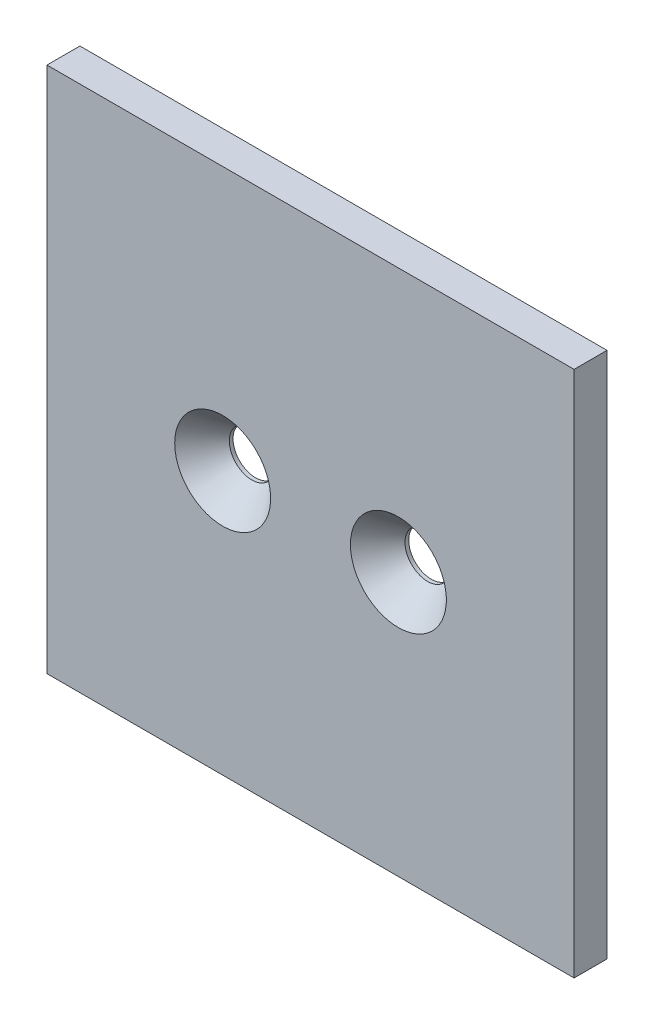
ISO-10303-21;
HEADER;
FILE_DESCRIPTION(('STEP AP214'),'2;1');
FILE_NAME('part.step','',(''),(''),'','','');
FILE_SCHEMA(('AUTOMOTIVE_DESIGN { 1 0 10303 214 1 1 1 1 }'));
ENDSEC;
DATA;
#1=APPLICATION_CONTEXT('core data for automotive mechanical design processes');
#2=APPLICATION_PROTOCOL_DEFINITION('international standard','automotive_design',2000,#1);
#3=PRODUCT_CONTEXT('',#1,'mechanical');
#4=PRODUCT('Part','Part','',(#3));
#5=PRODUCT_RELATED_PRODUCT_CATEGORY('part','',(#4));
#6=PRODUCT_DEFINITION_FORMATION('','',#4);
#7=PRODUCT_DEFINITION_CONTEXT('part definition',#1,'design');
#8=PRODUCT_DEFINITION('design','',#6,#7);
#9=PRODUCT_DEFINITION_SHAPE('','',#8);
#10=(LENGTH_UNIT() NAMED_UNIT(*) SI_UNIT(.MILLI.,.METRE.));
#11=(NAMED_UNIT(*) PLANE_ANGLE_UNIT() SI_UNIT($,.RADIAN.));
#12=(NAMED_UNIT(*) SI_UNIT($,.STERADIAN.) SOLID_ANGLE_UNIT());
#13=UNCERTAINTY_MEASURE_WITH_UNIT(LENGTH_MEASURE(1.E-05),#10,'distance_accuracy_value','');
#14=(GEOMETRIC_REPRESENTATION_CONTEXT(3) GLOBAL_UNCERTAINTY_ASSIGNED_CONTEXT((#13)) GLOBAL_UNIT_ASSIGNED_CONTEXT((#10,
#11,#12)) REPRESENTATION_CONTEXT('',''));
#15=CARTESIAN_POINT('',(0.,0.,0.));
#16=DIRECTION('',(0.,0.,1.));
#17=DIRECTION('',(1.,0.,0.));
#18=AXIS2_PLACEMENT_3D('',#15,#16,#17);
#19=CARTESIAN_POINT('',(0.,0.,2.38125));
#20=DIRECTION('',(0.,0.,1.));
#21=DIRECTION('',(1.,0.,0.));
#22=AXIS2_PLACEMENT_3D('',#19,#20,#21);
#23=PLANE('',#22);
#24=CARTESIAN_POINT('',(-12.7,0.,2.38125));
#25=DIRECTION('',(0.,0.,-1.));
#26=DIRECTION('',(-1.,0.,0.));
#27=AXIS2_PLACEMENT_3D('',#24,#25,#26);
#28=CIRCLE('',#27,6.9342);
#29=CARTESIAN_POINT('',(-19.6342,0.,2.38125));
#30=VERTEX_POINT('',#29);
#31=EDGE_CURVE('E110',#30,#30,#28,.T.);
#32=ORIENTED_EDGE('',*,*,#31,.T.);
#33=EDGE_LOOP('',(#32));
#34=FACE_BOUND('',#33,.T.);
#35=DIRECTION('',(0.,1.,0.));
#36=VECTOR('',#35,1.);
#37=CARTESIAN_POINT('',(38.1,38.1,2.38125));
#38=LINE('',#37,#36);
#39=CARTESIAN_POINT('',(38.1,-38.1,2.38125));
#40=VERTEX_POINT('',#39);
#41=CARTESIAN_POINT('',(38.1,38.1,2.38125));
#42=VERTEX_POINT('',#41);
#43=EDGE_CURVE('E86',#40,#42,#38,.T.);
#44=ORIENTED_EDGE('',*,*,#43,.T.);
#45=DIRECTION('',(-1.,0.,0.));
#46=VECTOR('',#45,1.);
#47=CARTESIAN_POINT('',(-38.1,38.1,2.38125));
#48=LINE('',#47,#46);
#49=CARTESIAN_POINT('',(-38.1,38.1,2.38125));
#50=VERTEX_POINT('',#49);
#51=EDGE_CURVE('E81',#42,#50,#48,.T.);
#52=ORIENTED_EDGE('',*,*,#51,.T.);
#53=DIRECTION('',(0.,-1.,0.));
#54=VECTOR('',#53,1.);
#55=CARTESIAN_POINT('',(-38.1,38.1,2.38125));
#56=LINE('',#55,#54);
#57=CARTESIAN_POINT('',(-38.1,-38.1,2.38125));
#58=VERTEX_POINT('',#57);
#59=EDGE_CURVE('E84',#50,#58,#56,.T.);
#60=ORIENTED_EDGE('',*,*,#59,.T.);
#61=DIRECTION('',(1.,0.,0.));
#62=VECTOR('',#61,1.);
#63=CARTESIAN_POINT('',(-38.1,-38.1,2.38125));
#64=LINE('',#63,#62);
#65=EDGE_CURVE('E51',#58,#40,#64,.T.);
#66=ORIENTED_EDGE('',*,*,#65,.T.);
#67=EDGE_LOOP('',(#44,#52,#60,#66));
#68=FACE_BOUND('',#67,.T.);
#69=CARTESIAN_POINT('',(12.7,0.,2.38125));
#70=DIRECTION('',(0.,0.,-1.));
#71=DIRECTION('',(-1.,0.,0.));
#72=AXIS2_PLACEMENT_3D('',#69,#70,#71);
#73=CIRCLE('',#72,6.9342);
#74=CARTESIAN_POINT('',(5.7658,0.,2.38125));
#75=VERTEX_POINT('',#74);
#76=EDGE_CURVE('E120',#75,#75,#73,.T.);
#77=ORIENTED_EDGE('',*,*,#76,.T.);
#78=EDGE_LOOP('',(#77));
#79=FACE_BOUND('',#78,.T.);
#80=ADVANCED_FACE('F32',(#34,#68,#79),#23,.T.);
#81=CARTESIAN_POINT('',(12.7,0.,2.38125));
#82=DIRECTION('',(0.,0.,-1.));
#83=DIRECTION('',(-1.,0.,0.));
#84=AXIS2_PLACEMENT_3D('',#81,#82,#83);
#85=CYLINDRICAL_SURFACE('',#84,3.2639);
#86=CARTESIAN_POINT('',(12.7,0.,-2.38125));
#87=DIRECTION('',(0.,0.,1.));
#88=DIRECTION('',(1.,0.,0.));
#89=AXIS2_PLACEMENT_3D('',#86,#87,#88);
#90=CIRCLE('',#89,3.2639);
#91=CARTESIAN_POINT('',(9.4361,0.,-2.38125));
#92=VERTEX_POINT('',#91);
#93=EDGE_CURVE('E109',#92,#92,#90,.T.);
#94=CARTESIAN_POINT('',(12.7,0.,-1.84094716502328));
#95=DIRECTION('',(0.,0.,1.));
#96=DIRECTION('',(1.,0.,0.));
#97=AXIS2_PLACEMENT_3D('',#94,#95,#96);
#98=CIRCLE('',#97,3.2639);
#99=CARTESIAN_POINT('',(9.4361,0.,-1.84094716502328));
#100=VERTEX_POINT('',#99);
#101=EDGE_CURVE('E36',#100,#100,#98,.T.);
#102=CARTESIAN_POINT('',(9.4361,0.,-2.38125));
#103=CARTESIAN_POINT('',(9.4361,0.,-2.37562184546899));
#104=CARTESIAN_POINT('',(9.4361,0.,-2.36999369093799));
#105=CARTESIAN_POINT('',(9.4361,0.,-2.35873738187597));
#106=CARTESIAN_POINT('',(9.4361,0.,-2.35310922734496));
#107=CARTESIAN_POINT('',(9.4361,0.,-2.34185291828295));
#108=CARTESIAN_POINT('',(9.4361,0.,-2.33622476375194));
#109=CARTESIAN_POINT('',(9.4361,0.,-2.32496845468993));
#110=CARTESIAN_POINT('',(9.4361,0.,-2.31934030015892));
#111=CARTESIAN_POINT('',(9.4361,0.,-2.3080839910969));
#112=CARTESIAN_POINT('',(9.4361,0.,-2.3024558365659));
#113=CARTESIAN_POINT('',(9.4361,0.,-2.29119952750388));
#114=CARTESIAN_POINT('',(9.4361,0.,-2.28557137297287));
#115=CARTESIAN_POINT('',(9.4361,0.,-2.27431506391086));
#116=CARTESIAN_POINT('',(9.4361,0.,-2.26868690937985));
#117=CARTESIAN_POINT('',(9.4361,0.,-2.25743060031784));
#118=CARTESIAN_POINT('',(9.4361,0.,-2.25180244578683));
#119=CARTESIAN_POINT('',(9.4361,0.,-2.24054613672481));
#120=CARTESIAN_POINT('',(9.4361,0.,-2.23491798219381));
#121=CARTESIAN_POINT('',(9.4361,0.,-2.22366167313179));
#122=CARTESIAN_POINT('',(9.4361,0.,-2.21803351860078));
#123=CARTESIAN_POINT('',(9.4361,0.,-2.20677720953877));
#124=CARTESIAN_POINT('',(9.4361,0.,-2.20114905500776));
#125=CARTESIAN_POINT('',(9.4361,0.,-2.18989274594575));
#126=CARTESIAN_POINT('',(9.4361,0.,-2.18426459141474));
#127=CARTESIAN_POINT('',(9.4361,0.,-2.17300828235272));
#128=CARTESIAN_POINT('',(9.4361,0.,-2.16738012782172));
#129=CARTESIAN_POINT('',(9.4361,0.,-2.1561238187597));
#130=CARTESIAN_POINT('',(9.4361,0.,-2.15049566422869));
#131=CARTESIAN_POINT('',(9.4361,0.,-2.13923935516668));
#132=CARTESIAN_POINT('',(9.4361,0.,-2.13361120063567));
#133=CARTESIAN_POINT('',(9.4361,0.,-2.12235489157366));
#134=CARTESIAN_POINT('',(9.4361,0.,-2.11672673704265));
#135=CARTESIAN_POINT('',(9.4361,0.,-2.10547042798063));
#136=CARTESIAN_POINT('',(9.4361,0.,-2.09984227344963));
#137=CARTESIAN_POINT('',(9.4361,0.,-2.08858596438761));
#138=CARTESIAN_POINT('',(9.4361,0.,-2.0829578098566));
#139=CARTESIAN_POINT('',(9.4361,0.,-2.07170150079459));
#140=CARTESIAN_POINT('',(9.4361,0.,-2.06607334626358));
#141=CARTESIAN_POINT('',(9.4361,0.,-2.05481703720157));
#142=CARTESIAN_POINT('',(9.4361,0.,-2.04918888267056));
#143=CARTESIAN_POINT('',(9.4361,0.,-2.03793257360855));
#144=CARTESIAN_POINT('',(9.4361,0.,-2.03230441907754));
#145=CARTESIAN_POINT('',(9.4361,0.,-2.02104811001552));
#146=CARTESIAN_POINT('',(9.4361,0.,-2.01541995548452));
#147=CARTESIAN_POINT('',(9.4361,0.,-2.0041636464225));
#148=CARTESIAN_POINT('',(9.4361,0.,-1.99853549189149));
#149=CARTESIAN_POINT('',(9.4361,0.,-1.98727918282948));
#150=CARTESIAN_POINT('',(9.4361,0.,-1.98165102829847));
#151=CARTESIAN_POINT('',(9.4361,0.,-1.97039471923646));
#152=CARTESIAN_POINT('',(9.4361,0.,-1.96476656470545));
#153=CARTESIAN_POINT('',(9.4361,0.,-1.95351025564343));
#154=CARTESIAN_POINT('',(9.4361,0.,-1.94788210111243));
#155=CARTESIAN_POINT('',(9.4361,0.,-1.93662579205041));
#156=CARTESIAN_POINT('',(9.4361,0.,-1.9309976375194));
#157=CARTESIAN_POINT('',(9.4361,0.,-1.91974132845739));
#158=CARTESIAN_POINT('',(9.4361,0.,-1.91411317392638));
#159=CARTESIAN_POINT('',(9.4361,0.,-1.90285686486437));
#160=CARTESIAN_POINT('',(9.4361,0.,-1.89722871033336));
#161=CARTESIAN_POINT('',(9.4361,0.,-1.88597240127134));
#162=CARTESIAN_POINT('',(9.4361,0.,-1.88034424674034));
#163=CARTESIAN_POINT('',(9.4361,0.,-1.86908793767832));
#164=CARTESIAN_POINT('',(9.4361,0.,-1.86345978314731));
#165=CARTESIAN_POINT('',(9.4361,0.,-1.8522034740853));
#166=CARTESIAN_POINT('',(9.4361,0.,-1.84657531955429));
#167=CARTESIAN_POINT('',(9.4361,0.,-1.84094716502328));
#168=B_SPLINE_CURVE_WITH_KNOTS('',3,(#102,#103,#104,#105,#106,#107,#108,#109,#110,#111,#112,
#113,#114,#115,#116,#117,#118,#119,#120,#121,#122,#123,#124,#125,#126,#127,#128,#129,#130,#131,
#132,#133,#134,#135,#136,#137,#138,#139,#140,#141,#142,#143,#144,#145,#146,#147,#148,#149,#150,
#151,#152,#153,#154,#155,#156,#157,#158,#159,#160,#161,#162,#163,#164,#165,#166,#167),
.UNSPECIFIED.,.F.,.F.,(4,2,2,2,2,2,2,2,2,2,2,2,2,2,2,2,2,2,2,2,2,2,2,2,2,2,2,2,2,2,2,2,4),(0.,
0.0168844635930225,0.0337689271860449,0.0506533907790674,0.0675378543720899,0.0844223179651115,
0.101306781558134,0.118191245151156,0.135075708744179,0.151960172337201,0.168844635930224,
0.185729099523246,0.202613563116268,0.21949802670929,0.236382490302313,0.253266953895335,
0.270151417488358,0.28703588108138,0.303920344674403,0.320804808267425,0.337689271860448,
0.354573735453469,0.371458199046492,0.388342662639514,0.405227126232537,0.422111589825559,
0.438996053418582,0.455880517011604,0.472764980604626,0.489649444197648,0.506533907790671,
0.523418371383693,0.540302834976716),.UNSPECIFIED.);
#169=EDGE_CURVE('BSEAM131',#92,#100,#168,.T.);
#170=ORIENTED_EDGE('',*,*,#93,.F.);
#171=ORIENTED_EDGE('',*,*,#101,.T.);
#172=ORIENTED_EDGE('',*,*,#169,.T.);
#173=ORIENTED_EDGE('',*,*,#169,.F.);
#174=EDGE_LOOP('',(#170,#172,#171,#173));
#175=FACE_BOUND('',#174,.T.);
#176=ADVANCED_FACE('F131',(#175),#85,.F.);
#177=CARTESIAN_POINT('',(-12.7,0.,2.38125));
#178=DIRECTION('',(0.,0.,-1.));
#179=DIRECTION('',(-1.,0.,0.));
#180=AXIS2_PLACEMENT_3D('',#177,#178,#179);
#181=CYLINDRICAL_SURFACE('',#180,3.2639);
#182=CARTESIAN_POINT('',(-12.7,0.,-2.38125));
#183=DIRECTION('',(0.,0.,1.));
#184=DIRECTION('',(1.,0.,0.));
#185=AXIS2_PLACEMENT_3D('',#182,#183,#184);
#186=CIRCLE('',#185,3.2639);
#187=CARTESIAN_POINT('',(-15.9639,0.,-2.38125));
#188=VERTEX_POINT('',#187);
#189=EDGE_CURVE('E102',#188,#188,#186,.T.);
#190=CARTESIAN_POINT('',(-12.7,0.,-1.84094716502328));
#191=DIRECTION('',(0.,0.,1.));
#192=DIRECTION('',(1.,0.,0.));
#193=AXIS2_PLACEMENT_3D('',#190,#191,#192);
#194=CIRCLE('',#193,3.2639);
#195=CARTESIAN_POINT('',(-15.9639,0.,-1.84094716502328));
#196=VERTEX_POINT('',#195);
#197=EDGE_CURVE('E107',#196,#196,#194,.T.);
#198=CARTESIAN_POINT('',(-15.9639,0.,-2.38125));
#199=CARTESIAN_POINT('',(-15.9639,0.,-2.37562184546899));
#200=CARTESIAN_POINT('',(-15.9639,0.,-2.36999369093799));
#201=CARTESIAN_POINT('',(-15.9639,0.,-2.35873738187597));
#202=CARTESIAN_POINT('',(-15.9639,0.,-2.35310922734496));
#203=CARTESIAN_POINT('',(-15.9639,0.,-2.34185291828295));
#204=CARTESIAN_POINT('',(-15.9639,0.,-2.33622476375194));
#205=CARTESIAN_POINT('',(-15.9639,0.,-2.32496845468993));
#206=CARTESIAN_POINT('',(-15.9639,0.,-2.31934030015892));
#207=CARTESIAN_POINT('',(-15.9639,0.,-2.3080839910969));
#208=CARTESIAN_POINT('',(-15.9639,0.,-2.3024558365659));
#209=CARTESIAN_POINT('',(-15.9639,0.,-2.29119952750388));
#210=CARTESIAN_POINT('',(-15.9639,0.,-2.28557137297287));
#211=CARTESIAN_POINT('',(-15.9639,0.,-2.27431506391086));
#212=CARTESIAN_POINT('',(-15.9639,0.,-2.26868690937985));
#213=CARTESIAN_POINT('',(-15.9639,0.,-2.25743060031784));
#214=CARTESIAN_POINT('',(-15.9639,0.,-2.25180244578683));
#215=CARTESIAN_POINT('',(-15.9639,0.,-2.24054613672481));
#216=CARTESIAN_POINT('',(-15.9639,0.,-2.23491798219381));
#217=CARTESIAN_POINT('',(-15.9639,0.,-2.22366167313179));
#218=CARTESIAN_POINT('',(-15.9639,0.,-2.21803351860078));
#219=CARTESIAN_POINT('',(-15.9639,0.,-2.20677720953877));
#220=CARTESIAN_POINT('',(-15.9639,0.,-2.20114905500776));
#221=CARTESIAN_POINT('',(-15.9639,0.,-2.18989274594575));
#222=CARTESIAN_POINT('',(-15.9639,0.,-2.18426459141474));
#223=CARTESIAN_POINT('',(-15.9639,0.,-2.17300828235272));
#224=CARTESIAN_POINT('',(-15.9639,0.,-2.16738012782172));
#225=CARTESIAN_POINT('',(-15.9639,0.,-2.1561238187597));
#226=CARTESIAN_POINT('',(-15.9639,0.,-2.15049566422869));
#227=CARTESIAN_POINT('',(-15.9639,0.,-2.13923935516668));
#228=CARTESIAN_POINT('',(-15.9639,0.,-2.13361120063567));
#229=CARTESIAN_POINT('',(-15.9639,0.,-2.12235489157366));
#230=CARTESIAN_POINT('',(-15.9639,0.,-2.11672673704265));
#231=CARTESIAN_POINT('',(-15.9639,0.,-2.10547042798063));
#232=CARTESIAN_POINT('',(-15.9639,0.,-2.09984227344963));
#233=CARTESIAN_POINT('',(-15.9639,0.,-2.08858596438761));
#234=CARTESIAN_POINT('',(-15.9639,0.,-2.0829578098566));
#235=CARTESIAN_POINT('',(-15.9639,0.,-2.07170150079459));
#236=CARTESIAN_POINT('',(-15.9639,0.,-2.06607334626358));
#237=CARTESIAN_POINT('',(-15.9639,0.,-2.05481703720157));
#238=CARTESIAN_POINT('',(-15.9639,0.,-2.04918888267056));
#239=CARTESIAN_POINT('',(-15.9639,0.,-2.03793257360855));
#240=CARTESIAN_POINT('',(-15.9639,0.,-2.03230441907754));
#241=CARTESIAN_POINT('',(-15.9639,0.,-2.02104811001552));
#242=CARTESIAN_POINT('',(-15.9639,0.,-2.01541995548452));
#243=CARTESIAN_POINT('',(-15.9639,0.,-2.0041636464225));
#244=CARTESIAN_POINT('',(-15.9639,0.,-1.99853549189149));
#245=CARTESIAN_POINT('',(-15.9639,0.,-1.98727918282948));
#246=CARTESIAN_POINT('',(-15.9639,0.,-1.98165102829847));
#247=CARTESIAN_POINT('',(-15.9639,0.,-1.97039471923646));
#248=CARTESIAN_POINT('',(-15.9639,0.,-1.96476656470545));
#249=CARTESIAN_POINT('',(-15.9639,0.,-1.95351025564343));
#250=CARTESIAN_POINT('',(-15.9639,0.,-1.94788210111243));
#251=CARTESIAN_POINT('',(-15.9639,0.,-1.93662579205041));
#252=CARTESIAN_POINT('',(-15.9639,0.,-1.9309976375194));
#253=CARTESIAN_POINT('',(-15.9639,0.,-1.91974132845739));
#254=CARTESIAN_POINT('',(-15.9639,0.,-1.91411317392638));
#255=CARTESIAN_POINT('',(-15.9639,0.,-1.90285686486437));
#256=CARTESIAN_POINT('',(-15.9639,0.,-1.89722871033336));
#257=CARTESIAN_POINT('',(-15.9639,0.,-1.88597240127134));
#258=CARTESIAN_POINT('',(-15.9639,0.,-1.88034424674034));
#259=CARTESIAN_POINT('',(-15.9639,0.,-1.86908793767832));
#260=CARTESIAN_POINT('',(-15.9639,0.,-1.86345978314731));
#261=CARTESIAN_POINT('',(-15.9639,0.,-1.8522034740853));
#262=CARTESIAN_POINT('',(-15.9639,0.,-1.84657531955429));
#263=CARTESIAN_POINT('',(-15.9639,0.,-1.84094716502328));
#264=B_SPLINE_CURVE_WITH_KNOTS('',3,(#198,#199,#200,#201,#202,#203,#204,#205,#206,#207,#208,
#209,#210,#211,#212,#213,#214,#215,#216,#217,#218,#219,#220,#221,#222,#223,#224,#225,#226,#227,
#228,#229,#230,#231,#232,#233,#234,#235,#236,#237,#238,#239,#240,#241,#242,#243,#244,#245,#246,
#247,#248,#249,#250,#251,#252,#253,#254,#255,#256,#257,#258,#259,#260,#261,#262,#263),
.UNSPECIFIED.,.F.,.F.,(4,2,2,2,2,2,2,2,2,2,2,2,2,2,2,2,2,2,2,2,2,2,2,2,2,2,2,2,2,2,2,2,4),(0.,
0.0168844635930225,0.0337689271860449,0.0506533907790674,0.0675378543720899,0.0844223179651115,
0.101306781558134,0.118191245151156,0.135075708744179,0.151960172337201,0.168844635930224,
0.185729099523246,0.202613563116268,0.21949802670929,0.236382490302313,0.253266953895335,
0.270151417488358,0.28703588108138,0.303920344674403,0.320804808267425,0.337689271860448,
0.354573735453469,0.371458199046492,0.388342662639514,0.405227126232537,0.422111589825559,
0.438996053418582,0.455880517011604,0.472764980604626,0.489649444197648,0.506533907790671,
0.523418371383693,0.540302834976716),.UNSPECIFIED.);
#265=EDGE_CURVE('BSEAM129',#188,#196,#264,.T.);
#266=ORIENTED_EDGE('',*,*,#189,.F.);
#267=ORIENTED_EDGE('',*,*,#197,.T.);
#268=ORIENTED_EDGE('',*,*,#265,.T.);
#269=ORIENTED_EDGE('',*,*,#265,.F.);
#270=EDGE_LOOP('',(#266,#268,#267,#269));
#271=FACE_BOUND('',#270,.T.);
#272=ADVANCED_FACE('F129',(#271),#181,.F.);
#273=CARTESIAN_POINT('',(0.,0.,-2.38125));
#274=DIRECTION('',(0.,0.,1.));
#275=DIRECTION('',(1.,0.,0.));
#276=AXIS2_PLACEMENT_3D('',#273,#274,#275);
#277=PLANE('',#276);
#278=ORIENTED_EDGE('',*,*,#189,.T.);
#279=EDGE_LOOP('',(#278));
#280=FACE_BOUND('',#279,.T.);
#281=DIRECTION('',(0.,1.,0.));
#282=VECTOR('',#281,1.);
#283=CARTESIAN_POINT('',(38.1,38.1,-2.38125));
#284=LINE('',#283,#282);
#285=CARTESIAN_POINT('',(38.1,-38.1,-2.38125));
#286=VERTEX_POINT('',#285);
#287=CARTESIAN_POINT('',(38.1,38.1,-2.38125));
#288=VERTEX_POINT('',#287);
#289=EDGE_CURVE('E99',#286,#288,#284,.T.);
#290=ORIENTED_EDGE('',*,*,#289,.F.);
#291=DIRECTION('',(1.,0.,0.));
#292=VECTOR('',#291,1.);
#293=CARTESIAN_POINT('',(-38.1,-38.1,-2.38125));
#294=LINE('',#293,#292);
#295=CARTESIAN_POINT('',(-38.1,-38.1,-2.38125));
#296=VERTEX_POINT('',#295);
#297=EDGE_CURVE('E74',#296,#286,#294,.T.);
#298=ORIENTED_EDGE('',*,*,#297,.F.);
#299=DIRECTION('',(0.,-1.,0.));
#300=VECTOR('',#299,1.);
#301=CARTESIAN_POINT('',(-38.1,38.1,-2.38125));
#302=LINE('',#301,#300);
#303=CARTESIAN_POINT('',(-38.1,38.1,-2.38125));
#304=VERTEX_POINT('',#303);
#305=EDGE_CURVE('E68',#304,#296,#302,.T.);
#306=ORIENTED_EDGE('',*,*,#305,.F.);
#307=DIRECTION('',(-1.,0.,0.));
#308=VECTOR('',#307,1.);
#309=CARTESIAN_POINT('',(-38.1,38.1,-2.38125));
#310=LINE('',#309,#308);
#311=EDGE_CURVE('E90',#288,#304,#310,.T.);
#312=ORIENTED_EDGE('',*,*,#311,.F.);
#313=EDGE_LOOP('',(#290,#298,#306,#312));
#314=FACE_BOUND('',#313,.T.);
#315=ORIENTED_EDGE('',*,*,#93,.T.);
#316=EDGE_LOOP('',(#315));
#317=FACE_BOUND('',#316,.T.);
#318=ADVANCED_FACE('F126',(#280,#314,#317),#277,.F.);
#319=CARTESIAN_POINT('',(38.1,38.1,2.38125));
#320=DIRECTION('',(-1.,0.,0.));
#321=DIRECTION('',(0.,-1.,0.));
#322=AXIS2_PLACEMENT_3D('',#319,#320,#321);
#323=PLANE('',#322);
#324=ORIENTED_EDGE('',*,*,#289,.T.);
#325=DIRECTION('',(0.,0.,-1.));
#326=VECTOR('',#325,1.);
#327=CARTESIAN_POINT('',(38.1,38.1,2.38125));
#328=LINE('',#327,#326);
#329=EDGE_CURVE('E11',#42,#288,#328,.T.);
#330=ORIENTED_EDGE('',*,*,#329,.F.);
#331=ORIENTED_EDGE('',*,*,#43,.F.);
#332=DIRECTION('',(0.,0.,-1.));
#333=VECTOR('',#332,1.);
#334=CARTESIAN_POINT('',(38.1,-38.1,2.38125));
#335=LINE('',#334,#333);
#336=EDGE_CURVE('E95',#40,#286,#335,.T.);
#337=ORIENTED_EDGE('',*,*,#336,.T.);
#338=EDGE_LOOP('',(#324,#330,#331,#337));
#339=FACE_BOUND('',#338,.T.);
#340=ADVANCED_FACE('F34',(#339),#323,.F.);
#341=CARTESIAN_POINT('',(-38.1,38.1,2.38125));
#342=DIRECTION('',(0.,-1.,0.));
#343=DIRECTION('',(0.,0.,-1.));
#344=AXIS2_PLACEMENT_3D('',#341,#342,#343);
#345=PLANE('',#344);
#346=ORIENTED_EDGE('',*,*,#311,.T.);
#347=DIRECTION('',(0.,0.,-1.));
#348=VECTOR('',#347,1.);
#349=CARTESIAN_POINT('',(-38.1,38.1,2.38125));
#350=LINE('',#349,#348);
#351=EDGE_CURVE('E42',#50,#304,#350,.T.);
#352=ORIENTED_EDGE('',*,*,#351,.F.);
#353=ORIENTED_EDGE('',*,*,#51,.F.);
#354=ORIENTED_EDGE('',*,*,#329,.T.);
#355=EDGE_LOOP('',(#346,#352,#353,#354));
#356=FACE_BOUND('',#355,.T.);
#357=ADVANCED_FACE('F89',(#356),#345,.F.);
#358=CARTESIAN_POINT('',(-38.1,38.1,2.38125));
#359=DIRECTION('',(1.,0.,0.));
#360=DIRECTION('',(0.,1.,0.));
#361=AXIS2_PLACEMENT_3D('',#358,#359,#360);
#362=PLANE('',#361);
#363=ORIENTED_EDGE('',*,*,#305,.T.);
#364=DIRECTION('',(0.,0.,-1.));
#365=VECTOR('',#364,1.);
#366=CARTESIAN_POINT('',(-38.1,-38.1,2.38125));
#367=LINE('',#366,#365);
#368=EDGE_CURVE('E91',#58,#296,#367,.T.);
#369=ORIENTED_EDGE('',*,*,#368,.F.);
#370=ORIENTED_EDGE('',*,*,#59,.F.);
#371=ORIENTED_EDGE('',*,*,#351,.T.);
#372=EDGE_LOOP('',(#363,#369,#370,#371));
#373=FACE_BOUND('',#372,.T.);
#374=ADVANCED_FACE('F93',(#373),#362,.F.);
#375=CARTESIAN_POINT('',(-38.1,-38.1,2.38125));
#376=DIRECTION('',(0.,1.,0.));
#377=DIRECTION('',(0.,0.,1.));
#378=AXIS2_PLACEMENT_3D('',#375,#376,#377);
#379=PLANE('',#378);
#380=ORIENTED_EDGE('',*,*,#297,.T.);
#381=ORIENTED_EDGE('',*,*,#336,.F.);
#382=ORIENTED_EDGE('',*,*,#65,.F.);
#383=ORIENTED_EDGE('',*,*,#368,.T.);
#384=EDGE_LOOP('',(#380,#381,#382,#383));
#385=FACE_BOUND('',#384,.T.);
#386=ADVANCED_FACE('F145',(#385),#379,.F.);
#387=CARTESIAN_POINT('',(-12.7,0.,2.38125));
#388=DIRECTION('',(0.,0.,1.));
#389=DIRECTION('',(1.,0.,0.));
#390=AXIS2_PLACEMENT_3D('',#387,#388,#389);
#391=CONICAL_SURFACE('',#390,6.9342,0.715584993317673);
#392=ORIENTED_EDGE('',*,*,#197,.F.);
#393=EDGE_LOOP('',(#392));
#394=FACE_BOUND('',#393,.T.);
#395=ORIENTED_EDGE('',*,*,#31,.F.);
#396=EDGE_LOOP('',(#395));
#397=FACE_BOUND('',#396,.T.);
#398=ADVANCED_FACE('F148',(#394,#397),#391,.F.);
#399=CARTESIAN_POINT('',(12.7,0.,2.38125));
#400=DIRECTION('',(0.,0.,1.));
#401=DIRECTION('',(1.,0.,0.));
#402=AXIS2_PLACEMENT_3D('',#399,#400,#401);
#403=CONICAL_SURFACE('',#402,6.9342,0.715584993317673);
#404=ORIENTED_EDGE('',*,*,#101,.F.);
#405=EDGE_LOOP('',(#404));
#406=FACE_BOUND('',#405,.T.);
#407=ORIENTED_EDGE('',*,*,#76,.F.);
#408=EDGE_LOOP('',(#407));
#409=FACE_BOUND('',#408,.T.);
#410=ADVANCED_FACE('F163',(#406,#409),#403,.F.);
#411=CLOSED_SHELL('',(#80,#176,#272,#318,#340,#357,#374,#386,#398,#410));
#412=MANIFOLD_SOLID_BREP('B2',#411);
#413=ADVANCED_BREP_SHAPE_REPRESENTATION('',(#18,#412),#14);
#414=SHAPE_DEFINITION_REPRESENTATION(#9,#413);
ENDSEC;
END-ISO-10303-21;
